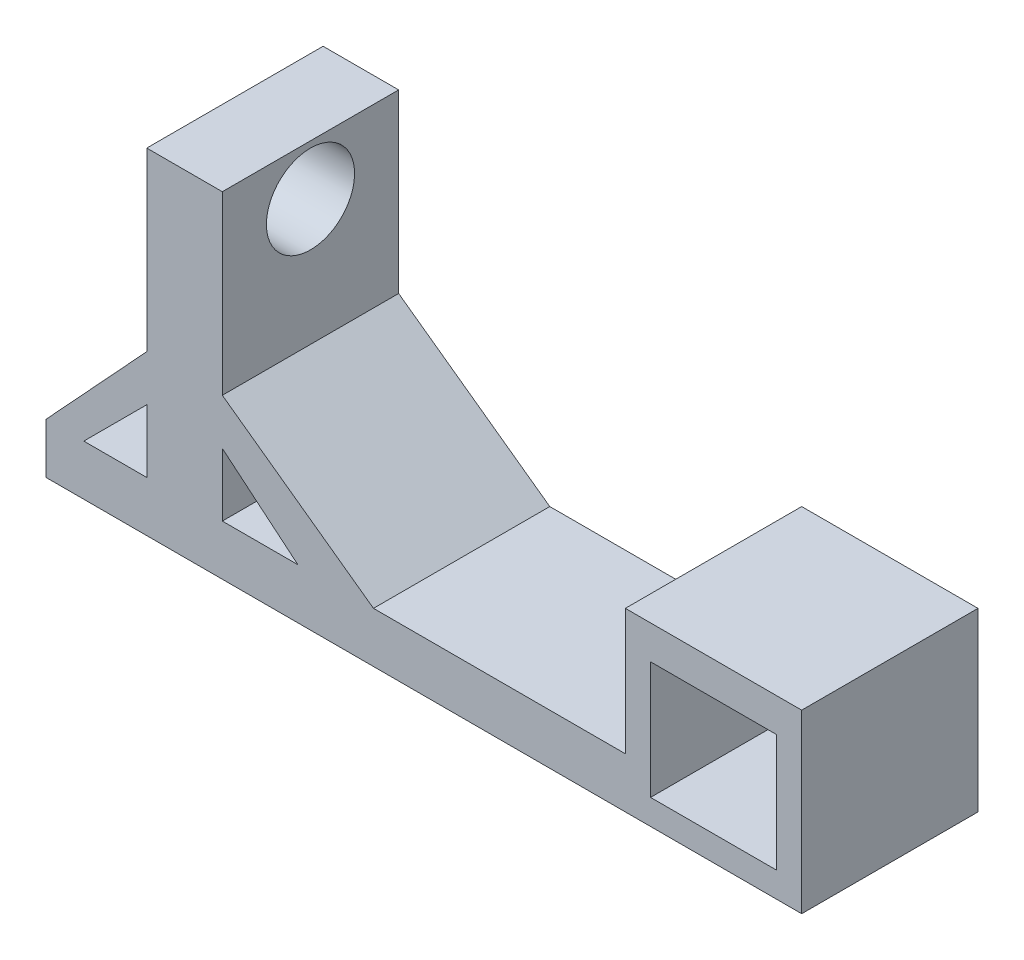
ISO-10303-21;
HEADER;
FILE_DESCRIPTION(('STEP AP214'),'2;1');
FILE_NAME('part.step','',(''),(''),'','','');
FILE_SCHEMA(('AUTOMOTIVE_DESIGN { 1 0 10303 214 1 1 1 1 }'));
ENDSEC;
DATA;
#1=APPLICATION_CONTEXT('core data for automotive mechanical design processes');
#2=APPLICATION_PROTOCOL_DEFINITION('international standard','automotive_design',2000,#1);
#3=PRODUCT_CONTEXT('',#1,'mechanical');
#4=PRODUCT('Part','Part','',(#3));
#5=PRODUCT_RELATED_PRODUCT_CATEGORY('part','',(#4));
#6=PRODUCT_DEFINITION_FORMATION('','',#4);
#7=PRODUCT_DEFINITION_CONTEXT('part definition',#1,'design');
#8=PRODUCT_DEFINITION('design','',#6,#7);
#9=PRODUCT_DEFINITION_SHAPE('','',#8);
#10=(LENGTH_UNIT() NAMED_UNIT(*) SI_UNIT(.MILLI.,.METRE.));
#11=(NAMED_UNIT(*) PLANE_ANGLE_UNIT() SI_UNIT($,.RADIAN.));
#12=(NAMED_UNIT(*) SI_UNIT($,.STERADIAN.) SOLID_ANGLE_UNIT());
#13=UNCERTAINTY_MEASURE_WITH_UNIT(LENGTH_MEASURE(1.E-05),#10,'distance_accuracy_value','');
#14=(GEOMETRIC_REPRESENTATION_CONTEXT(3) GLOBAL_UNCERTAINTY_ASSIGNED_CONTEXT((#13)) GLOBAL_UNIT_ASSIGNED_CONTEXT((#10,
#11,#12)) REPRESENTATION_CONTEXT('',''));
#15=CARTESIAN_POINT('',(0.,0.,0.));
#16=DIRECTION('',(0.,0.,1.));
#17=DIRECTION('',(1.,0.,0.));
#18=AXIS2_PLACEMENT_3D('',#15,#16,#17);
#19=CARTESIAN_POINT('',(-65.25,63.2499999999999,70.));
#20=DIRECTION('',(0.,-1.,0.));
#21=DIRECTION('',(0.,0.,-1.));
#22=AXIS2_PLACEMENT_3D('',#19,#20,#21);
#23=PLANE('',#22);
#24=DIRECTION('',(-1.,0.,0.));
#25=VECTOR('',#24,1.);
#26=CARTESIAN_POINT('',(-65.25,63.2499999999999,0.));
#27=LINE('',#26,#25);
#28=CARTESIAN_POINT('',(-35.25,63.2499999999999,0.));
#29=VERTEX_POINT('',#28);
#30=CARTESIAN_POINT('',(-65.25,63.2499999999999,0.));
#31=VERTEX_POINT('',#30);
#32=EDGE_CURVE('E295',#29,#31,#27,.T.);
#33=ORIENTED_EDGE('',*,*,#32,.T.);
#34=DIRECTION('',(0.,0.,-1.));
#35=VECTOR('',#34,1.);
#36=CARTESIAN_POINT('',(-65.25,63.2499999999999,70.));
#37=LINE('',#36,#35);
#38=CARTESIAN_POINT('',(-65.25,63.2499999999999,70.));
#39=VERTEX_POINT('',#38);
#40=EDGE_CURVE('E11',#39,#31,#37,.T.);
#41=ORIENTED_EDGE('',*,*,#40,.F.);
#42=DIRECTION('',(-1.,0.,0.));
#43=VECTOR('',#42,1.);
#44=CARTESIAN_POINT('',(-65.25,63.2499999999999,70.));
#45=LINE('',#44,#43);
#46=CARTESIAN_POINT('',(-35.25,63.2499999999999,70.));
#47=VERTEX_POINT('',#46);
#48=EDGE_CURVE('E305',#47,#39,#45,.T.);
#49=ORIENTED_EDGE('',*,*,#48,.F.);
#50=DIRECTION('',(0.,0.,-1.));
#51=VECTOR('',#50,1.);
#52=CARTESIAN_POINT('',(-35.25,63.2499999999999,70.));
#53=LINE('',#52,#51);
#54=EDGE_CURVE('E340',#47,#29,#53,.T.);
#55=ORIENTED_EDGE('',*,*,#54,.T.);
#56=EDGE_LOOP('',(#33,#41,#49,#55));
#57=FACE_BOUND('',#56,.T.);
#58=ADVANCED_FACE('F39',(#57),#23,.F.);
#59=CARTESIAN_POINT('',(-65.25,63.2499999999999,70.));
#60=DIRECTION('',(1.,0.,0.));
#61=DIRECTION('',(0.,1.,0.));
#62=AXIS2_PLACEMENT_3D('',#59,#60,#61);
#63=PLANE('',#62);
#64=CARTESIAN_POINT('',(-65.25,43.2499999999999,35.));
#65=DIRECTION('',(1.,0.,0.));
#66=DIRECTION('',(0.,1.,0.));
#67=AXIS2_PLACEMENT_3D('',#64,#65,#66);
#68=CIRCLE('',#67,17.5);
#69=CARTESIAN_POINT('',(-65.25,60.7499999999999,35.));
#70=VERTEX_POINT('',#69);
#71=EDGE_CURVE('E256',#70,#70,#68,.F.);
#72=ORIENTED_EDGE('',*,*,#71,.F.);
#73=EDGE_LOOP('',(#72));
#74=FACE_BOUND('',#73,.T.);
#75=DIRECTION('',(0.,-1.,0.));
#76=VECTOR('',#75,1.);
#77=CARTESIAN_POINT('',(-65.25,63.2499999999999,0.));
#78=LINE('',#77,#76);
#79=CARTESIAN_POINT('',(-65.25,-6.75000000000006,0.));
#80=VERTEX_POINT('',#79);
#81=EDGE_CURVE('E344',#31,#80,#78,.T.);
#82=ORIENTED_EDGE('',*,*,#81,.T.);
#83=DIRECTION('',(0.,0.,-1.));
#84=VECTOR('',#83,1.);
#85=CARTESIAN_POINT('',(-65.25,-6.75000000000006,70.));
#86=LINE('',#85,#84);
#87=CARTESIAN_POINT('',(-65.25,-6.75000000000006,70.));
#88=VERTEX_POINT('',#87);
#89=EDGE_CURVE('E47',#88,#80,#86,.T.);
#90=ORIENTED_EDGE('',*,*,#89,.F.);
#91=DIRECTION('',(0.,-1.,0.));
#92=VECTOR('',#91,1.);
#93=CARTESIAN_POINT('',(-65.25,63.2499999999999,70.));
#94=LINE('',#93,#92);
#95=EDGE_CURVE('E309',#39,#88,#94,.T.);
#96=ORIENTED_EDGE('',*,*,#95,.F.);
#97=ORIENTED_EDGE('',*,*,#40,.T.);
#98=EDGE_LOOP('',(#82,#90,#96,#97));
#99=FACE_BOUND('',#98,.T.);
#100=ADVANCED_FACE('F435',(#74,#99),#63,.F.);
#101=CARTESIAN_POINT('',(-65.25,-6.75000000000006,70.));
#102=DIRECTION('',(0.734152322249424,-0.67898480670467,0.));
#103=DIRECTION('',(0.67898480670467,0.734152322249424,0.));
#104=AXIS2_PLACEMENT_3D('',#101,#102,#103);
#105=PLANE('',#104);
#106=DIRECTION('',(-0.67898480670467,-0.734152322249424,0.));
#107=VECTOR('',#106,1.);
#108=CARTESIAN_POINT('',(-65.25,-6.75000000000006,0.));
#109=LINE('',#108,#107);
#110=CARTESIAN_POINT('',(-105.25,-50.,0.));
#111=VERTEX_POINT('',#110);
#112=EDGE_CURVE('E347',#80,#111,#109,.T.);
#113=ORIENTED_EDGE('',*,*,#112,.T.);
#114=DIRECTION('',(0.,0.,-1.));
#115=VECTOR('',#114,1.);
#116=CARTESIAN_POINT('',(-105.25,-50.,70.));
#117=LINE('',#116,#115);
#118=CARTESIAN_POINT('',(-105.25,-50.,70.));
#119=VERTEX_POINT('',#118);
#120=EDGE_CURVE('E404',#119,#111,#117,.T.);
#121=ORIENTED_EDGE('',*,*,#120,.F.);
#122=DIRECTION('',(-0.67898480670467,-0.734152322249424,0.));
#123=VECTOR('',#122,1.);
#124=CARTESIAN_POINT('',(-65.25,-6.75000000000006,70.));
#125=LINE('',#124,#123);
#126=EDGE_CURVE('E313',#88,#119,#125,.T.);
#127=ORIENTED_EDGE('',*,*,#126,.F.);
#128=ORIENTED_EDGE('',*,*,#89,.T.);
#129=EDGE_LOOP('',(#113,#121,#127,#128));
#130=FACE_BOUND('',#129,.T.);
#131=ADVANCED_FACE('F413',(#130),#105,.F.);
#132=CARTESIAN_POINT('',(-105.25,-50.,70.));
#133=DIRECTION('',(1.,0.,0.));
#134=DIRECTION('',(0.,0.,-1.));
#135=AXIS2_PLACEMENT_3D('',#132,#133,#134);
#136=PLANE('',#135);
#137=DIRECTION('',(0.,-1.,0.));
#138=VECTOR('',#137,1.);
#139=CARTESIAN_POINT('',(-105.25,-50.,0.));
#140=LINE('',#139,#138);
#141=CARTESIAN_POINT('',(-105.25,-70.,0.));
#142=VERTEX_POINT('',#141);
#143=EDGE_CURVE('E350',#111,#142,#140,.T.);
#144=ORIENTED_EDGE('',*,*,#143,.T.);
#145=DIRECTION('',(0.,0.,-1.));
#146=VECTOR('',#145,1.);
#147=CARTESIAN_POINT('',(-105.25,-70.,70.));
#148=LINE('',#147,#146);
#149=CARTESIAN_POINT('',(-105.25,-70.,70.));
#150=VERTEX_POINT('',#149);
#151=EDGE_CURVE('E400',#150,#142,#148,.T.);
#152=ORIENTED_EDGE('',*,*,#151,.F.);
#153=DIRECTION('',(0.,-1.,0.));
#154=VECTOR('',#153,1.);
#155=CARTESIAN_POINT('',(-105.25,-50.,70.));
#156=LINE('',#155,#154);
#157=EDGE_CURVE('E316',#119,#150,#156,.T.);
#158=ORIENTED_EDGE('',*,*,#157,.F.);
#159=ORIENTED_EDGE('',*,*,#120,.T.);
#160=EDGE_LOOP('',(#144,#152,#158,#159));
#161=FACE_BOUND('',#160,.T.);
#162=ADVANCED_FACE('F423',(#161),#136,.F.);
#163=CARTESIAN_POINT('',(-105.25,-70.,70.));
#164=DIRECTION('',(0.,1.,0.));
#165=DIRECTION('',(0.,0.,1.));
#166=AXIS2_PLACEMENT_3D('',#163,#164,#165);
#167=PLANE('',#166);
#168=DIRECTION('',(1.,0.,0.));
#169=VECTOR('',#168,1.);
#170=CARTESIAN_POINT('',(-105.25,-70.,0.));
#171=LINE('',#170,#169);
#172=CARTESIAN_POINT('',(194.75,-70.,0.));
#173=VERTEX_POINT('',#172);
#174=EDGE_CURVE('E353',#142,#173,#171,.T.);
#175=ORIENTED_EDGE('',*,*,#174,.T.);
#176=DIRECTION('',(0.,0.,-1.));
#177=VECTOR('',#176,1.);
#178=CARTESIAN_POINT('',(194.75,-70.,70.));
#179=LINE('',#178,#177);
#180=CARTESIAN_POINT('',(194.75,-70.,70.));
#181=VERTEX_POINT('',#180);
#182=EDGE_CURVE('E396',#181,#173,#179,.T.);
#183=ORIENTED_EDGE('',*,*,#182,.F.);
#184=DIRECTION('',(1.,0.,0.));
#185=VECTOR('',#184,1.);
#186=CARTESIAN_POINT('',(-105.25,-70.,70.));
#187=LINE('',#186,#185);
#188=EDGE_CURVE('E319',#150,#181,#187,.T.);
#189=ORIENTED_EDGE('',*,*,#188,.F.);
#190=ORIENTED_EDGE('',*,*,#151,.T.);
#191=EDGE_LOOP('',(#175,#183,#189,#190));
#192=FACE_BOUND('',#191,.T.);
#193=ADVANCED_FACE('F427',(#192),#167,.F.);
#194=CARTESIAN_POINT('',(194.75,-70.,70.));
#195=DIRECTION('',(-1.,0.,0.));
#196=DIRECTION('',(0.,0.,1.));
#197=AXIS2_PLACEMENT_3D('',#194,#195,#196);
#198=PLANE('',#197);
#199=DIRECTION('',(0.,1.,0.));
#200=VECTOR('',#199,1.);
#201=CARTESIAN_POINT('',(194.75,-70.,0.));
#202=LINE('',#201,#200);
#203=CARTESIAN_POINT('',(194.75,0.,0.));
#204=VERTEX_POINT('',#203);
#205=EDGE_CURVE('E356',#173,#204,#202,.T.);
#206=ORIENTED_EDGE('',*,*,#205,.T.);
#207=DIRECTION('',(0.,0.,-1.));
#208=VECTOR('',#207,1.);
#209=CARTESIAN_POINT('',(194.75,0.,70.));
#210=LINE('',#209,#208);
#211=CARTESIAN_POINT('',(194.75,0.,70.));
#212=VERTEX_POINT('',#211);
#213=EDGE_CURVE('E392',#212,#204,#210,.T.);
#214=ORIENTED_EDGE('',*,*,#213,.F.);
#215=DIRECTION('',(0.,1.,0.));
#216=VECTOR('',#215,1.);
#217=CARTESIAN_POINT('',(194.75,-70.,70.));
#218=LINE('',#217,#216);
#219=EDGE_CURVE('E322',#181,#212,#218,.T.);
#220=ORIENTED_EDGE('',*,*,#219,.F.);
#221=ORIENTED_EDGE('',*,*,#182,.T.);
#222=EDGE_LOOP('',(#206,#214,#220,#221));
#223=FACE_BOUND('',#222,.T.);
#224=ADVANCED_FACE('F463',(#223),#198,.F.);
#225=CARTESIAN_POINT('',(194.75,0.,70.));
#226=DIRECTION('',(0.,-1.,0.));
#227=DIRECTION('',(1.,0.,0.));
#228=AXIS2_PLACEMENT_3D('',#225,#226,#227);
#229=PLANE('',#228);
#230=DIRECTION('',(-1.,0.,0.));
#231=VECTOR('',#230,1.);
#232=CARTESIAN_POINT('',(194.75,0.,0.));
#233=LINE('',#232,#231);
#234=CARTESIAN_POINT('',(124.75,0.,0.));
#235=VERTEX_POINT('',#234);
#236=EDGE_CURVE('E359',#204,#235,#233,.T.);
#237=ORIENTED_EDGE('',*,*,#236,.T.);
#238=DIRECTION('',(0.,0.,-1.));
#239=VECTOR('',#238,1.);
#240=CARTESIAN_POINT('',(124.75,0.,70.));
#241=LINE('',#240,#239);
#242=CARTESIAN_POINT('',(124.75,0.,70.));
#243=VERTEX_POINT('',#242);
#244=EDGE_CURVE('E388',#243,#235,#241,.T.);
#245=ORIENTED_EDGE('',*,*,#244,.F.);
#246=DIRECTION('',(-1.,0.,0.));
#247=VECTOR('',#246,1.);
#248=CARTESIAN_POINT('',(194.75,0.,70.));
#249=LINE('',#248,#247);
#250=EDGE_CURVE('E325',#212,#243,#249,.T.);
#251=ORIENTED_EDGE('',*,*,#250,.F.);
#252=ORIENTED_EDGE('',*,*,#213,.T.);
#253=EDGE_LOOP('',(#237,#245,#251,#252));
#254=FACE_BOUND('',#253,.T.);
#255=ADVANCED_FACE('F461',(#254),#229,.F.);
#256=CARTESIAN_POINT('',(124.75,0.,70.));
#257=DIRECTION('',(1.,0.,0.));
#258=DIRECTION('',(0.,0.,-1.));
#259=AXIS2_PLACEMENT_3D('',#256,#257,#258);
#260=PLANE('',#259);
#261=DIRECTION('',(0.,-1.,0.));
#262=VECTOR('',#261,1.);
#263=CARTESIAN_POINT('',(124.75,0.,0.));
#264=LINE('',#263,#262);
#265=CARTESIAN_POINT('',(124.75,-50.,0.));
#266=VERTEX_POINT('',#265);
#267=EDGE_CURVE('E362',#235,#266,#264,.T.);
#268=ORIENTED_EDGE('',*,*,#267,.T.);
#269=DIRECTION('',(0.,0.,-1.));
#270=VECTOR('',#269,1.);
#271=CARTESIAN_POINT('',(124.75,-50.,70.));
#272=LINE('',#271,#270);
#273=CARTESIAN_POINT('',(124.75,-50.,70.));
#274=VERTEX_POINT('',#273);
#275=EDGE_CURVE('E384',#274,#266,#272,.T.);
#276=ORIENTED_EDGE('',*,*,#275,.F.);
#277=DIRECTION('',(0.,-1.,0.));
#278=VECTOR('',#277,1.);
#279=CARTESIAN_POINT('',(124.75,0.,70.));
#280=LINE('',#279,#278);
#281=EDGE_CURVE('E328',#243,#274,#280,.T.);
#282=ORIENTED_EDGE('',*,*,#281,.F.);
#283=ORIENTED_EDGE('',*,*,#244,.T.);
#284=EDGE_LOOP('',(#268,#276,#282,#283));
#285=FACE_BOUND('',#284,.T.);
#286=ADVANCED_FACE('F456',(#285),#260,.F.);
#287=CARTESIAN_POINT('',(124.75,-50.,70.));
#288=DIRECTION('',(0.,-1.,0.));
#289=DIRECTION('',(1.,0.,0.));
#290=AXIS2_PLACEMENT_3D('',#287,#288,#289);
#291=PLANE('',#290);
#292=DIRECTION('',(-1.,0.,0.));
#293=VECTOR('',#292,1.);
#294=CARTESIAN_POINT('',(124.75,-50.,0.));
#295=LINE('',#294,#293);
#296=CARTESIAN_POINT('',(24.75,-50.,0.));
#297=VERTEX_POINT('',#296);
#298=EDGE_CURVE('E365',#266,#297,#295,.T.);
#299=ORIENTED_EDGE('',*,*,#298,.T.);
#300=DIRECTION('',(0.,0.,-1.));
#301=VECTOR('',#300,1.);
#302=CARTESIAN_POINT('',(24.75,-50.,70.));
#303=LINE('',#302,#301);
#304=CARTESIAN_POINT('',(24.75,-50.,70.));
#305=VERTEX_POINT('',#304);
#306=EDGE_CURVE('E380',#305,#297,#303,.T.);
#307=ORIENTED_EDGE('',*,*,#306,.F.);
#308=DIRECTION('',(-1.,0.,0.));
#309=VECTOR('',#308,1.);
#310=CARTESIAN_POINT('',(124.75,-50.,70.));
#311=LINE('',#310,#309);
#312=EDGE_CURVE('E331',#274,#305,#311,.T.);
#313=ORIENTED_EDGE('',*,*,#312,.F.);
#314=ORIENTED_EDGE('',*,*,#275,.T.);
#315=EDGE_LOOP('',(#299,#307,#313,#314));
#316=FACE_BOUND('',#315,.T.);
#317=ADVANCED_FACE('F451',(#316),#291,.F.);
#318=CARTESIAN_POINT('',(24.75,-50.,70.));
#319=DIRECTION('',(-0.584749850895914,-0.811213665982771,0.));
#320=DIRECTION('',(0.811213665982771,-0.584749850895914,0.));
#321=AXIS2_PLACEMENT_3D('',#318,#319,#320);
#322=PLANE('',#321);
#323=DIRECTION('',(-0.811213665982771,0.584749850895914,0.));
#324=VECTOR('',#323,1.);
#325=CARTESIAN_POINT('',(24.75,-50.,0.));
#326=LINE('',#325,#324);
#327=CARTESIAN_POINT('',(-35.25,-6.75000000000007,0.));
#328=VERTEX_POINT('',#327);
#329=EDGE_CURVE('E368',#297,#328,#326,.T.);
#330=ORIENTED_EDGE('',*,*,#329,.T.);
#331=DIRECTION('',(0.,0.,-1.));
#332=VECTOR('',#331,1.);
#333=CARTESIAN_POINT('',(-35.25,-6.75000000000007,70.));
#334=LINE('',#333,#332);
#335=CARTESIAN_POINT('',(-35.25,-6.75000000000007,70.));
#336=VERTEX_POINT('',#335);
#337=EDGE_CURVE('E376',#336,#328,#334,.T.);
#338=ORIENTED_EDGE('',*,*,#337,.F.);
#339=DIRECTION('',(-0.811213665982771,0.584749850895914,0.));
#340=VECTOR('',#339,1.);
#341=CARTESIAN_POINT('',(24.75,-50.,70.));
#342=LINE('',#341,#340);
#343=EDGE_CURVE('E334',#305,#336,#342,.T.);
#344=ORIENTED_EDGE('',*,*,#343,.F.);
#345=ORIENTED_EDGE('',*,*,#306,.T.);
#346=EDGE_LOOP('',(#330,#338,#344,#345));
#347=FACE_BOUND('',#346,.T.);
#348=ADVANCED_FACE('F447',(#347),#322,.F.);
#349=CARTESIAN_POINT('',(-35.25,-6.75000000000007,70.));
#350=DIRECTION('',(-1.,0.,0.));
#351=DIRECTION('',(0.,-1.,0.));
#352=AXIS2_PLACEMENT_3D('',#349,#350,#351);
#353=PLANE('',#352);
#354=CARTESIAN_POINT('',(-35.25,43.2499999999999,35.));
#355=DIRECTION('',(1.,0.,0.));
#356=DIRECTION('',(0.,1.,0.));
#357=AXIS2_PLACEMENT_3D('',#354,#355,#356);
#358=CIRCLE('',#357,17.5);
#359=CARTESIAN_POINT('',(-35.25,60.7499999999999,35.));
#360=VERTEX_POINT('',#359);
#361=EDGE_CURVE('E220',#360,#360,#358,.T.);
#362=ORIENTED_EDGE('',*,*,#361,.F.);
#363=EDGE_LOOP('',(#362));
#364=FACE_BOUND('',#363,.T.);
#365=DIRECTION('',(0.,1.,0.));
#366=VECTOR('',#365,1.);
#367=CARTESIAN_POINT('',(-35.25,-6.75000000000007,0.));
#368=LINE('',#367,#366);
#369=EDGE_CURVE('E310',#328,#29,#368,.T.);
#370=ORIENTED_EDGE('',*,*,#369,.T.);
#371=ORIENTED_EDGE('',*,*,#54,.F.);
#372=DIRECTION('',(0.,1.,0.));
#373=VECTOR('',#372,1.);
#374=CARTESIAN_POINT('',(-35.25,-6.75000000000007,70.));
#375=LINE('',#374,#373);
#376=EDGE_CURVE('E337',#336,#47,#375,.T.);
#377=ORIENTED_EDGE('',*,*,#376,.F.);
#378=ORIENTED_EDGE('',*,*,#337,.T.);
#379=EDGE_LOOP('',(#370,#371,#377,#378));
#380=FACE_BOUND('',#379,.T.);
#381=ADVANCED_FACE('F442',(#364,#380),#353,.F.);
#382=CARTESIAN_POINT('',(0.,0.,70.));
#383=DIRECTION('',(0.,0.,1.));
#384=DIRECTION('',(1.,0.,0.));
#385=AXIS2_PLACEMENT_3D('',#382,#383,#384);
#386=PLANE('',#385);
#387=DIRECTION('',(0.,1.,0.));
#388=VECTOR('',#387,1.);
#389=CARTESIAN_POINT('',(-65.25,-50.,70.));
#390=LINE('',#389,#388);
#391=CARTESIAN_POINT('',(-65.25,-50.,70.));
#392=VERTEX_POINT('',#391);
#393=CARTESIAN_POINT('',(-65.25,-25.,70.));
#394=VERTEX_POINT('',#393);
#395=EDGE_CURVE('E54',#392,#394,#390,.T.);
#396=ORIENTED_EDGE('',*,*,#395,.F.);
#397=DIRECTION('',(1.,0.,0.));
#398=VECTOR('',#397,1.);
#399=CARTESIAN_POINT('',(-90.25,-50.,70.));
#400=LINE('',#399,#398);
#401=CARTESIAN_POINT('',(-90.25,-50.,70.));
#402=VERTEX_POINT('',#401);
#403=EDGE_CURVE('E203',#402,#392,#400,.T.);
#404=ORIENTED_EDGE('',*,*,#403,.F.);
#405=DIRECTION('',(-0.707106781186547,-0.707106781186548,0.));
#406=VECTOR('',#405,1.);
#407=CARTESIAN_POINT('',(-65.25,-25.,70.));
#408=LINE('',#407,#406);
#409=EDGE_CURVE('E207',#394,#402,#408,.T.);
#410=ORIENTED_EDGE('',*,*,#409,.F.);
#411=EDGE_LOOP('',(#396,#404,#410));
#412=FACE_BOUND('',#411,.T.);
#413=DIRECTION('',(-0.768221279597376,0.64018439966448,0.));
#414=VECTOR('',#413,1.);
#415=CARTESIAN_POINT('',(-5.25000000000002,-50.,70.));
#416=LINE('',#415,#414);
#417=CARTESIAN_POINT('',(-5.25000000000002,-50.,70.));
#418=VERTEX_POINT('',#417);
#419=CARTESIAN_POINT('',(-35.25,-25.,70.));
#420=VERTEX_POINT('',#419);
#421=EDGE_CURVE('E62',#418,#420,#416,.T.);
#422=ORIENTED_EDGE('',*,*,#421,.F.);
#423=DIRECTION('',(1.,0.,0.));
#424=VECTOR('',#423,1.);
#425=CARTESIAN_POINT('',(-35.25,-50.,70.));
#426=LINE('',#425,#424);
#427=CARTESIAN_POINT('',(-35.25,-50.,70.));
#428=VERTEX_POINT('',#427);
#429=EDGE_CURVE('E228',#428,#418,#426,.T.);
#430=ORIENTED_EDGE('',*,*,#429,.F.);
#431=DIRECTION('',(0.,-1.,0.));
#432=VECTOR('',#431,1.);
#433=CARTESIAN_POINT('',(-35.25,-25.,70.));
#434=LINE('',#433,#432);
#435=EDGE_CURVE('E239',#420,#428,#434,.T.);
#436=ORIENTED_EDGE('',*,*,#435,.F.);
#437=EDGE_LOOP('',(#422,#430,#436));
#438=FACE_BOUND('',#437,.T.);
#439=DIRECTION('',(-1.,0.,0.));
#440=VECTOR('',#439,1.);
#441=CARTESIAN_POINT('',(184.75,-13.3761807396648,70.));
#442=LINE('',#441,#440);
#443=CARTESIAN_POINT('',(184.75,-13.3761807396648,70.));
#444=VERTEX_POINT('',#443);
#445=CARTESIAN_POINT('',(134.75,-13.3761807396648,70.));
#446=VERTEX_POINT('',#445);
#447=EDGE_CURVE('E260',#444,#446,#442,.T.);
#448=ORIENTED_EDGE('',*,*,#447,.F.);
#449=DIRECTION('',(0.,1.,0.));
#450=VECTOR('',#449,1.);
#451=CARTESIAN_POINT('',(184.75,-60.,70.));
#452=LINE('',#451,#450);
#453=CARTESIAN_POINT('',(184.75,-60.,70.));
#454=VERTEX_POINT('',#453);
#455=EDGE_CURVE('E266',#454,#444,#452,.T.);
#456=ORIENTED_EDGE('',*,*,#455,.F.);
#457=DIRECTION('',(1.,0.,0.));
#458=VECTOR('',#457,1.);
#459=CARTESIAN_POINT('',(134.75,-60.,70.));
#460=LINE('',#459,#458);
#461=CARTESIAN_POINT('',(134.75,-60.,70.));
#462=VERTEX_POINT('',#461);
#463=EDGE_CURVE('E285',#462,#454,#460,.T.);
#464=ORIENTED_EDGE('',*,*,#463,.F.);
#465=DIRECTION('',(0.,-1.,0.));
#466=VECTOR('',#465,1.);
#467=CARTESIAN_POINT('',(134.75,-13.3761807396648,70.));
#468=LINE('',#467,#466);
#469=EDGE_CURVE('E281',#446,#462,#468,.T.);
#470=ORIENTED_EDGE('',*,*,#469,.F.);
#471=EDGE_LOOP('',(#448,#456,#464,#470));
#472=FACE_BOUND('',#471,.T.);
#473=ORIENTED_EDGE('',*,*,#48,.T.);
#474=ORIENTED_EDGE('',*,*,#95,.T.);
#475=ORIENTED_EDGE('',*,*,#126,.T.);
#476=ORIENTED_EDGE('',*,*,#157,.T.);
#477=ORIENTED_EDGE('',*,*,#188,.T.);
#478=ORIENTED_EDGE('',*,*,#219,.T.);
#479=ORIENTED_EDGE('',*,*,#250,.T.);
#480=ORIENTED_EDGE('',*,*,#281,.T.);
#481=ORIENTED_EDGE('',*,*,#312,.T.);
#482=ORIENTED_EDGE('',*,*,#343,.T.);
#483=ORIENTED_EDGE('',*,*,#376,.T.);
#484=EDGE_LOOP('',(#473,#474,#475,#476,#477,#478,#479,#480,#481,#482,#483));
#485=FACE_BOUND('',#484,.T.);
#486=ADVANCED_FACE('F431',(#412,#438,#472,#485),#386,.T.);
#487=CARTESIAN_POINT('',(0.,0.,0.));
#488=DIRECTION('',(0.,0.,1.));
#489=DIRECTION('',(1.,0.,0.));
#490=AXIS2_PLACEMENT_3D('',#487,#488,#489);
#491=PLANE('',#490);
#492=DIRECTION('',(1.,0.,0.));
#493=VECTOR('',#492,1.);
#494=CARTESIAN_POINT('',(-90.25,-50.,0.));
#495=LINE('',#494,#493);
#496=CARTESIAN_POINT('',(-90.25,-50.,0.));
#497=VERTEX_POINT('',#496);
#498=CARTESIAN_POINT('',(-65.25,-50.,0.));
#499=VERTEX_POINT('',#498);
#500=EDGE_CURVE('E191',#497,#499,#495,.T.);
#501=ORIENTED_EDGE('',*,*,#500,.T.);
#502=DIRECTION('',(0.,1.,0.));
#503=VECTOR('',#502,1.);
#504=CARTESIAN_POINT('',(-65.25,-50.,0.));
#505=LINE('',#504,#503);
#506=CARTESIAN_POINT('',(-65.25,-25.,0.));
#507=VERTEX_POINT('',#506);
#508=EDGE_CURVE('E184',#499,#507,#505,.T.);
#509=ORIENTED_EDGE('',*,*,#508,.T.);
#510=DIRECTION('',(-0.707106781186547,-0.707106781186548,0.));
#511=VECTOR('',#510,1.);
#512=CARTESIAN_POINT('',(-65.25,-25.,0.));
#513=LINE('',#512,#511);
#514=EDGE_CURVE('E195',#507,#497,#513,.T.);
#515=ORIENTED_EDGE('',*,*,#514,.T.);
#516=EDGE_LOOP('',(#501,#509,#515));
#517=FACE_BOUND('',#516,.T.);
#518=DIRECTION('',(1.,0.,0.));
#519=VECTOR('',#518,1.);
#520=CARTESIAN_POINT('',(-35.25,-50.,0.));
#521=LINE('',#520,#519);
#522=CARTESIAN_POINT('',(-35.25,-50.,0.));
#523=VERTEX_POINT('',#522);
#524=CARTESIAN_POINT('',(-5.25000000000002,-50.,0.));
#525=VERTEX_POINT('',#524);
#526=EDGE_CURVE('E232',#523,#525,#521,.T.);
#527=ORIENTED_EDGE('',*,*,#526,.T.);
#528=DIRECTION('',(-0.768221279597376,0.64018439966448,0.));
#529=VECTOR('',#528,1.);
#530=CARTESIAN_POINT('',(-5.25000000000002,-50.,0.));
#531=LINE('',#530,#529);
#532=CARTESIAN_POINT('',(-35.25,-25.,0.));
#533=VERTEX_POINT('',#532);
#534=EDGE_CURVE('E223',#525,#533,#531,.T.);
#535=ORIENTED_EDGE('',*,*,#534,.T.);
#536=DIRECTION('',(0.,-1.,0.));
#537=VECTOR('',#536,1.);
#538=CARTESIAN_POINT('',(-35.25,-25.,0.));
#539=LINE('',#538,#537);
#540=EDGE_CURVE('E227',#533,#523,#539,.T.);
#541=ORIENTED_EDGE('',*,*,#540,.T.);
#542=EDGE_LOOP('',(#527,#535,#541));
#543=FACE_BOUND('',#542,.T.);
#544=DIRECTION('',(0.,1.,0.));
#545=VECTOR('',#544,1.);
#546=CARTESIAN_POINT('',(184.75,-60.,0.));
#547=LINE('',#546,#545);
#548=CARTESIAN_POINT('',(184.75,-60.,0.));
#549=VERTEX_POINT('',#548);
#550=CARTESIAN_POINT('',(184.75,-13.3761807396648,0.));
#551=VERTEX_POINT('',#550);
#552=EDGE_CURVE('E274',#549,#551,#547,.T.);
#553=ORIENTED_EDGE('',*,*,#552,.T.);
#554=DIRECTION('',(-1.,0.,0.));
#555=VECTOR('',#554,1.);
#556=CARTESIAN_POINT('',(184.75,-13.3761807396648,0.));
#557=LINE('',#556,#555);
#558=CARTESIAN_POINT('',(134.75,-13.3761807396648,0.));
#559=VERTEX_POINT('',#558);
#560=EDGE_CURVE('E261',#551,#559,#557,.T.);
#561=ORIENTED_EDGE('',*,*,#560,.T.);
#562=DIRECTION('',(0.,-1.,0.));
#563=VECTOR('',#562,1.);
#564=CARTESIAN_POINT('',(134.75,-13.3761807396648,0.));
#565=LINE('',#564,#563);
#566=CARTESIAN_POINT('',(134.75,-60.,0.));
#567=VERTEX_POINT('',#566);
#568=EDGE_CURVE('E265',#559,#567,#565,.T.);
#569=ORIENTED_EDGE('',*,*,#568,.T.);
#570=DIRECTION('',(1.,0.,0.));
#571=VECTOR('',#570,1.);
#572=CARTESIAN_POINT('',(134.75,-60.,0.));
#573=LINE('',#572,#571);
#574=EDGE_CURVE('E270',#567,#549,#573,.T.);
#575=ORIENTED_EDGE('',*,*,#574,.T.);
#576=EDGE_LOOP('',(#553,#561,#569,#575));
#577=FACE_BOUND('',#576,.T.);
#578=ORIENTED_EDGE('',*,*,#32,.F.);
#579=ORIENTED_EDGE('',*,*,#369,.F.);
#580=ORIENTED_EDGE('',*,*,#329,.F.);
#581=ORIENTED_EDGE('',*,*,#298,.F.);
#582=ORIENTED_EDGE('',*,*,#267,.F.);
#583=ORIENTED_EDGE('',*,*,#236,.F.);
#584=ORIENTED_EDGE('',*,*,#205,.F.);
#585=ORIENTED_EDGE('',*,*,#174,.F.);
#586=ORIENTED_EDGE('',*,*,#143,.F.);
#587=ORIENTED_EDGE('',*,*,#112,.F.);
#588=ORIENTED_EDGE('',*,*,#81,.F.);
#589=EDGE_LOOP('',(#578,#579,#580,#581,#582,#583,#584,#585,#586,#587,#588));
#590=FACE_BOUND('',#589,.T.);
#591=ADVANCED_FACE('F200',(#517,#543,#577,#590),#491,.F.);
#592=CARTESIAN_POINT('',(184.75,-13.3761807396648,0.));
#593=DIRECTION('',(0.,1.,0.));
#594=DIRECTION('',(-1.,0.,0.));
#595=AXIS2_PLACEMENT_3D('',#592,#593,#594);
#596=PLANE('',#595);
#597=ORIENTED_EDGE('',*,*,#447,.T.);
#598=DIRECTION('',(0.,0.,1.));
#599=VECTOR('',#598,1.);
#600=CARTESIAN_POINT('',(134.75,-13.3761807396648,0.));
#601=LINE('',#600,#599);
#602=EDGE_CURVE('E278',#559,#446,#601,.T.);
#603=ORIENTED_EDGE('',*,*,#602,.F.);
#604=ORIENTED_EDGE('',*,*,#560,.F.);
#605=DIRECTION('',(0.,0.,1.));
#606=VECTOR('',#605,1.);
#607=CARTESIAN_POINT('',(184.75,-13.3761807396648,0.));
#608=LINE('',#607,#606);
#609=EDGE_CURVE('E292',#551,#444,#608,.T.);
#610=ORIENTED_EDGE('',*,*,#609,.T.);
#611=EDGE_LOOP('',(#597,#603,#604,#610));
#612=FACE_BOUND('',#611,.T.);
#613=ADVANCED_FACE('F533',(#612),#596,.F.);
#614=CARTESIAN_POINT('',(184.75,-60.,0.));
#615=DIRECTION('',(1.,0.,0.));
#616=DIRECTION('',(0.,0.,-1.));
#617=AXIS2_PLACEMENT_3D('',#614,#615,#616);
#618=PLANE('',#617);
#619=ORIENTED_EDGE('',*,*,#455,.T.);
#620=ORIENTED_EDGE('',*,*,#609,.F.);
#621=ORIENTED_EDGE('',*,*,#552,.F.);
#622=DIRECTION('',(0.,0.,1.));
#623=VECTOR('',#622,1.);
#624=CARTESIAN_POINT('',(184.75,-60.,0.));
#625=LINE('',#624,#623);
#626=EDGE_CURVE('E296',#549,#454,#625,.T.);
#627=ORIENTED_EDGE('',*,*,#626,.T.);
#628=EDGE_LOOP('',(#619,#620,#621,#627));
#629=FACE_BOUND('',#628,.T.);
#630=ADVANCED_FACE('F538',(#629),#618,.F.);
#631=CARTESIAN_POINT('',(134.75,-60.,0.));
#632=DIRECTION('',(0.,-1.,0.));
#633=DIRECTION('',(0.,0.,-1.));
#634=AXIS2_PLACEMENT_3D('',#631,#632,#633);
#635=PLANE('',#634);
#636=ORIENTED_EDGE('',*,*,#463,.T.);
#637=ORIENTED_EDGE('',*,*,#626,.F.);
#638=ORIENTED_EDGE('',*,*,#574,.F.);
#639=DIRECTION('',(0.,0.,1.));
#640=VECTOR('',#639,1.);
#641=CARTESIAN_POINT('',(134.75,-60.,0.));
#642=LINE('',#641,#640);
#643=EDGE_CURVE('E299',#567,#462,#642,.T.);
#644=ORIENTED_EDGE('',*,*,#643,.T.);
#645=EDGE_LOOP('',(#636,#637,#638,#644));
#646=FACE_BOUND('',#645,.T.);
#647=ADVANCED_FACE('F550',(#646),#635,.F.);
#648=CARTESIAN_POINT('',(134.75,-13.3761807396648,0.));
#649=DIRECTION('',(-1.,0.,0.));
#650=DIRECTION('',(0.,0.,1.));
#651=AXIS2_PLACEMENT_3D('',#648,#649,#650);
#652=PLANE('',#651);
#653=ORIENTED_EDGE('',*,*,#469,.T.);
#654=ORIENTED_EDGE('',*,*,#643,.F.);
#655=ORIENTED_EDGE('',*,*,#568,.F.);
#656=ORIENTED_EDGE('',*,*,#602,.T.);
#657=EDGE_LOOP('',(#653,#654,#655,#656));
#658=FACE_BOUND('',#657,.T.);
#659=ADVANCED_FACE('F560',(#658),#652,.F.);
#660=CARTESIAN_POINT('',(-105.251,43.2499999999999,35.));
#661=DIRECTION('',(1.,0.,0.));
#662=DIRECTION('',(0.,1.,0.));
#663=AXIS2_PLACEMENT_3D('',#660,#661,#662);
#664=CYLINDRICAL_SURFACE('',#663,17.5);
#665=ORIENTED_EDGE('',*,*,#361,.T.);
#666=EDGE_LOOP('',(#665));
#667=FACE_BOUND('',#666,.T.);
#668=ORIENTED_EDGE('',*,*,#71,.T.);
#669=EDGE_LOOP('',(#668));
#670=FACE_BOUND('',#669,.T.);
#671=ADVANCED_FACE('F569',(#667,#670),#664,.F.);
#672=CARTESIAN_POINT('',(-5.25000000000002,-50.,0.));
#673=DIRECTION('',(0.64018439966448,0.768221279597376,0.));
#674=DIRECTION('',(-0.768221279597376,0.64018439966448,0.));
#675=AXIS2_PLACEMENT_3D('',#672,#673,#674);
#676=PLANE('',#675);
#677=ORIENTED_EDGE('',*,*,#421,.T.);
#678=DIRECTION('',(0.,0.,1.));
#679=VECTOR('',#678,1.);
#680=CARTESIAN_POINT('',(-35.25,-25.,0.));
#681=LINE('',#680,#679);
#682=EDGE_CURVE('E236',#533,#420,#681,.T.);
#683=ORIENTED_EDGE('',*,*,#682,.F.);
#684=ORIENTED_EDGE('',*,*,#534,.F.);
#685=DIRECTION('',(0.,0.,1.));
#686=VECTOR('',#685,1.);
#687=CARTESIAN_POINT('',(-5.25000000000002,-50.,0.));
#688=LINE('',#687,#686);
#689=EDGE_CURVE('E214',#525,#418,#688,.T.);
#690=ORIENTED_EDGE('',*,*,#689,.T.);
#691=EDGE_LOOP('',(#677,#683,#684,#690));
#692=FACE_BOUND('',#691,.T.);
#693=ADVANCED_FACE('F595',(#692),#676,.F.);
#694=CARTESIAN_POINT('',(-35.25,-50.,0.));
#695=DIRECTION('',(0.,-1.,0.));
#696=DIRECTION('',(1.,0.,0.));
#697=AXIS2_PLACEMENT_3D('',#694,#695,#696);
#698=PLANE('',#697);
#699=ORIENTED_EDGE('',*,*,#429,.T.);
#700=ORIENTED_EDGE('',*,*,#689,.F.);
#701=ORIENTED_EDGE('',*,*,#526,.F.);
#702=DIRECTION('',(0.,0.,1.));
#703=VECTOR('',#702,1.);
#704=CARTESIAN_POINT('',(-35.25,-50.,0.));
#705=LINE('',#704,#703);
#706=EDGE_CURVE('E248',#523,#428,#705,.T.);
#707=ORIENTED_EDGE('',*,*,#706,.T.);
#708=EDGE_LOOP('',(#699,#700,#701,#707));
#709=FACE_BOUND('',#708,.T.);
#710=ADVANCED_FACE('F618',(#709),#698,.F.);
#711=CARTESIAN_POINT('',(-35.25,-25.,0.));
#712=DIRECTION('',(-1.,0.,0.));
#713=DIRECTION('',(0.,0.,1.));
#714=AXIS2_PLACEMENT_3D('',#711,#712,#713);
#715=PLANE('',#714);
#716=ORIENTED_EDGE('',*,*,#435,.T.);
#717=ORIENTED_EDGE('',*,*,#706,.F.);
#718=ORIENTED_EDGE('',*,*,#540,.F.);
#719=ORIENTED_EDGE('',*,*,#682,.T.);
#720=EDGE_LOOP('',(#716,#717,#718,#719));
#721=FACE_BOUND('',#720,.T.);
#722=ADVANCED_FACE('F627',(#721),#715,.F.);
#723=CARTESIAN_POINT('',(-65.25,-50.,0.));
#724=DIRECTION('',(1.,0.,0.));
#725=DIRECTION('',(0.,0.,-1.));
#726=AXIS2_PLACEMENT_3D('',#723,#724,#725);
#727=PLANE('',#726);
#728=ORIENTED_EDGE('',*,*,#395,.T.);
#729=DIRECTION('',(0.,0.,1.));
#730=VECTOR('',#729,1.);
#731=CARTESIAN_POINT('',(-65.25,-25.,0.));
#732=LINE('',#731,#730);
#733=EDGE_CURVE('E180',#507,#394,#732,.T.);
#734=ORIENTED_EDGE('',*,*,#733,.F.);
#735=ORIENTED_EDGE('',*,*,#508,.F.);
#736=DIRECTION('',(0.,0.,1.));
#737=VECTOR('',#736,1.);
#738=CARTESIAN_POINT('',(-65.25,-50.,0.));
#739=LINE('',#738,#737);
#740=EDGE_CURVE('E217',#499,#392,#739,.T.);
#741=ORIENTED_EDGE('',*,*,#740,.T.);
#742=EDGE_LOOP('',(#728,#734,#735,#741));
#743=FACE_BOUND('',#742,.T.);
#744=ADVANCED_FACE('F182',(#743),#727,.F.);
#745=CARTESIAN_POINT('',(-90.25,-50.,0.));
#746=DIRECTION('',(0.,-1.,0.));
#747=DIRECTION('',(0.,0.,-1.));
#748=AXIS2_PLACEMENT_3D('',#745,#746,#747);
#749=PLANE('',#748);
#750=ORIENTED_EDGE('',*,*,#403,.T.);
#751=ORIENTED_EDGE('',*,*,#740,.F.);
#752=ORIENTED_EDGE('',*,*,#500,.F.);
#753=DIRECTION('',(0.,0.,1.));
#754=VECTOR('',#753,1.);
#755=CARTESIAN_POINT('',(-90.25,-50.,0.));
#756=LINE('',#755,#754);
#757=EDGE_CURVE('E190',#497,#402,#756,.T.);
#758=ORIENTED_EDGE('',*,*,#757,.T.);
#759=EDGE_LOOP('',(#750,#751,#752,#758));
#760=FACE_BOUND('',#759,.T.);
#761=ADVANCED_FACE('F646',(#760),#749,.F.);
#762=CARTESIAN_POINT('',(-65.25,-25.,0.));
#763=DIRECTION('',(-0.707106781186548,0.707106781186547,0.));
#764=DIRECTION('',(-0.707106781186547,-0.707106781186548,0.));
#765=AXIS2_PLACEMENT_3D('',#762,#763,#764);
#766=PLANE('',#765);
#767=ORIENTED_EDGE('',*,*,#409,.T.);
#768=ORIENTED_EDGE('',*,*,#757,.F.);
#769=ORIENTED_EDGE('',*,*,#514,.F.);
#770=ORIENTED_EDGE('',*,*,#733,.T.);
#771=EDGE_LOOP('',(#767,#768,#769,#770));
#772=FACE_BOUND('',#771,.T.);
#773=ADVANCED_FACE('F196',(#772),#766,.F.);
#774=CLOSED_SHELL('',(#58,#100,#131,#162,#193,#224,#255,#286,#317,#348,#381,#486,#591,#613,#630,
#647,#659,#671,#693,#710,#722,#744,#761,#773));
#775=MANIFOLD_SOLID_BREP('B2',#774);
#776=ADVANCED_BREP_SHAPE_REPRESENTATION('',(#18,#775),#14);
#777=SHAPE_DEFINITION_REPRESENTATION(#9,#776);
ENDSEC;
END-ISO-10303-21;
